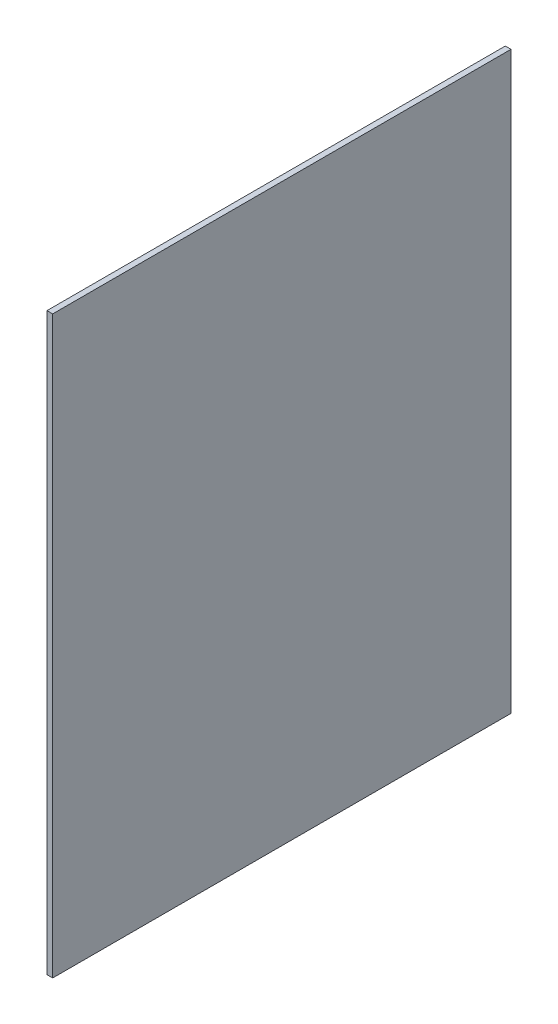
ISO-10303-21;
HEADER;
FILE_DESCRIPTION(('STEP AP214'),'2;1');
FILE_NAME('part.step','',(''),(''),'','','');
FILE_SCHEMA(('AUTOMOTIVE_DESIGN { 1 0 10303 214 1 1 1 1 }'));
ENDSEC;
DATA;
#1=APPLICATION_CONTEXT('core data for automotive mechanical design processes');
#2=APPLICATION_PROTOCOL_DEFINITION('international standard','automotive_design',2000,#1);
#3=PRODUCT_CONTEXT('',#1,'mechanical');
#4=PRODUCT('Part','Part','',(#3));
#5=PRODUCT_RELATED_PRODUCT_CATEGORY('part','',(#4));
#6=PRODUCT_DEFINITION_FORMATION('','',#4);
#7=PRODUCT_DEFINITION_CONTEXT('part definition',#1,'design');
#8=PRODUCT_DEFINITION('design','',#6,#7);
#9=PRODUCT_DEFINITION_SHAPE('','',#8);
#10=(LENGTH_UNIT() NAMED_UNIT(*) SI_UNIT(.MILLI.,.METRE.));
#11=(NAMED_UNIT(*) PLANE_ANGLE_UNIT() SI_UNIT($,.RADIAN.));
#12=(NAMED_UNIT(*) SI_UNIT($,.STERADIAN.) SOLID_ANGLE_UNIT());
#13=UNCERTAINTY_MEASURE_WITH_UNIT(LENGTH_MEASURE(1.E-05),#10,'distance_accuracy_value','');
#14=(GEOMETRIC_REPRESENTATION_CONTEXT(3) GLOBAL_UNCERTAINTY_ASSIGNED_CONTEXT((#13)) GLOBAL_UNIT_ASSIGNED_CONTEXT((#10,
#11,#12)) REPRESENTATION_CONTEXT('',''));
#15=CARTESIAN_POINT('',(0.,0.,0.));
#16=DIRECTION('',(0.,0.,1.));
#17=DIRECTION('',(1.,0.,0.));
#18=AXIS2_PLACEMENT_3D('',#15,#16,#17);
#19=CARTESIAN_POINT('',(150.88108,-140.88108,112.268));
#20=DIRECTION('',(0.,1.,0.));
#21=DIRECTION('',(0.,0.,1.));
#22=AXIS2_PLACEMENT_3D('',#19,#20,#21);
#23=PLANE('',#22);
#24=DIRECTION('',(1.,0.,0.));
#25=VECTOR('',#24,1.);
#26=CARTESIAN_POINT('',(150.88108,-140.88108,0.));
#27=LINE('',#26,#25);
#28=CARTESIAN_POINT('',(150.88108,-140.88108,0.));
#29=VERTEX_POINT('',#28);
#30=CARTESIAN_POINT('',(152.27554,-140.88108,0.));
#31=VERTEX_POINT('',#30);
#32=EDGE_CURVE('E97',#29,#31,#27,.T.);
#33=ORIENTED_EDGE('',*,*,#32,.T.);
#34=DIRECTION('',(0.,0.,-1.));
#35=VECTOR('',#34,1.);
#36=CARTESIAN_POINT('',(152.27554,-140.88108,112.268));
#37=LINE('',#36,#35);
#38=CARTESIAN_POINT('',(152.27554,-140.88108,112.268));
#39=VERTEX_POINT('',#38);
#40=EDGE_CURVE('E11',#39,#31,#37,.T.);
#41=ORIENTED_EDGE('',*,*,#40,.F.);
#42=DIRECTION('',(1.,0.,0.));
#43=VECTOR('',#42,1.);
#44=CARTESIAN_POINT('',(150.88108,-140.88108,112.268));
#45=LINE('',#44,#43);
#46=CARTESIAN_POINT('',(150.88108,-140.88108,112.268));
#47=VERTEX_POINT('',#46);
#48=EDGE_CURVE('E85',#47,#39,#45,.T.);
#49=ORIENTED_EDGE('',*,*,#48,.F.);
#50=DIRECTION('',(0.,0.,-1.));
#51=VECTOR('',#50,1.);
#52=CARTESIAN_POINT('',(150.88108,-140.88108,112.268));
#53=LINE('',#52,#51);
#54=EDGE_CURVE('E93',#47,#29,#53,.T.);
#55=ORIENTED_EDGE('',*,*,#54,.T.);
#56=EDGE_LOOP('',(#33,#41,#49,#55));
#57=FACE_BOUND('',#56,.T.);
#58=ADVANCED_FACE('F34',(#57),#23,.F.);
#59=CARTESIAN_POINT('',(152.27554,0.,112.268));
#60=DIRECTION('',(-1.,0.,0.));
#61=DIRECTION('',(0.,-1.,0.));
#62=AXIS2_PLACEMENT_3D('',#59,#60,#61);
#63=PLANE('',#62);
#64=DIRECTION('',(0.,1.,0.));
#65=VECTOR('',#64,1.);
#66=CARTESIAN_POINT('',(152.27554,0.,0.));
#67=LINE('',#66,#65);
#68=CARTESIAN_POINT('',(152.27554,0.,0.));
#69=VERTEX_POINT('',#68);
#70=EDGE_CURVE('E89',#31,#69,#67,.T.);
#71=ORIENTED_EDGE('',*,*,#70,.T.);
#72=DIRECTION('',(0.,0.,-1.));
#73=VECTOR('',#72,1.);
#74=CARTESIAN_POINT('',(152.27554,0.,112.268));
#75=LINE('',#74,#73);
#76=CARTESIAN_POINT('',(152.27554,0.,112.268));
#77=VERTEX_POINT('',#76);
#78=EDGE_CURVE('E42',#77,#69,#75,.T.);
#79=ORIENTED_EDGE('',*,*,#78,.F.);
#80=DIRECTION('',(0.,1.,0.));
#81=VECTOR('',#80,1.);
#82=CARTESIAN_POINT('',(152.27554,0.,112.268));
#83=LINE('',#82,#81);
#84=EDGE_CURVE('E80',#39,#77,#83,.T.);
#85=ORIENTED_EDGE('',*,*,#84,.F.);
#86=ORIENTED_EDGE('',*,*,#40,.T.);
#87=EDGE_LOOP('',(#71,#79,#85,#86));
#88=FACE_BOUND('',#87,.T.);
#89=ADVANCED_FACE('F88',(#88),#63,.F.);
#90=CARTESIAN_POINT('',(150.88108,0.,112.268));
#91=DIRECTION('',(0.,-1.,0.));
#92=DIRECTION('',(0.,0.,-1.));
#93=AXIS2_PLACEMENT_3D('',#90,#91,#92);
#94=PLANE('',#93);
#95=DIRECTION('',(-1.,0.,0.));
#96=VECTOR('',#95,1.);
#97=CARTESIAN_POINT('',(150.88108,0.,0.));
#98=LINE('',#97,#96);
#99=CARTESIAN_POINT('',(150.88108,0.,0.));
#100=VERTEX_POINT('',#99);
#101=EDGE_CURVE('E67',#69,#100,#98,.T.);
#102=ORIENTED_EDGE('',*,*,#101,.T.);
#103=DIRECTION('',(0.,0.,-1.));
#104=VECTOR('',#103,1.);
#105=CARTESIAN_POINT('',(150.88108,0.,112.268));
#106=LINE('',#105,#104);
#107=CARTESIAN_POINT('',(150.88108,0.,112.268));
#108=VERTEX_POINT('',#107);
#109=EDGE_CURVE('E90',#108,#100,#106,.T.);
#110=ORIENTED_EDGE('',*,*,#109,.F.);
#111=DIRECTION('',(-1.,0.,0.));
#112=VECTOR('',#111,1.);
#113=CARTESIAN_POINT('',(150.88108,0.,112.268));
#114=LINE('',#113,#112);
#115=EDGE_CURVE('E83',#77,#108,#114,.T.);
#116=ORIENTED_EDGE('',*,*,#115,.F.);
#117=ORIENTED_EDGE('',*,*,#78,.T.);
#118=EDGE_LOOP('',(#102,#110,#116,#117));
#119=FACE_BOUND('',#118,.T.);
#120=ADVANCED_FACE('F91',(#119),#94,.F.);
#121=CARTESIAN_POINT('',(150.88108,-140.88108,112.268));
#122=DIRECTION('',(1.,0.,0.));
#123=DIRECTION('',(0.,1.,0.));
#124=AXIS2_PLACEMENT_3D('',#121,#122,#123);
#125=PLANE('',#124);
#126=DIRECTION('',(0.,-1.,0.));
#127=VECTOR('',#126,1.);
#128=CARTESIAN_POINT('',(150.88108,-140.88108,0.));
#129=LINE('',#128,#127);
#130=EDGE_CURVE('E73',#100,#29,#129,.T.);
#131=ORIENTED_EDGE('',*,*,#130,.T.);
#132=ORIENTED_EDGE('',*,*,#54,.F.);
#133=DIRECTION('',(0.,-1.,0.));
#134=VECTOR('',#133,1.);
#135=CARTESIAN_POINT('',(150.88108,-140.88108,112.268));
#136=LINE('',#135,#134);
#137=EDGE_CURVE('E50',#108,#47,#136,.T.);
#138=ORIENTED_EDGE('',*,*,#137,.F.);
#139=ORIENTED_EDGE('',*,*,#109,.T.);
#140=EDGE_LOOP('',(#131,#132,#138,#139));
#141=FACE_BOUND('',#140,.T.);
#142=ADVANCED_FACE('F104',(#141),#125,.F.);
#143=CARTESIAN_POINT('',(0.,0.,112.268));
#144=DIRECTION('',(0.,0.,-1.));
#145=DIRECTION('',(-1.,0.,0.));
#146=AXIS2_PLACEMENT_3D('',#143,#144,#145);
#147=PLANE('',#146);
#148=ORIENTED_EDGE('',*,*,#48,.T.);
#149=ORIENTED_EDGE('',*,*,#84,.T.);
#150=ORIENTED_EDGE('',*,*,#115,.T.);
#151=ORIENTED_EDGE('',*,*,#137,.T.);
#152=EDGE_LOOP('',(#148,#149,#150,#151));
#153=FACE_BOUND('',#152,.T.);
#154=ADVANCED_FACE('F81',(#153),#147,.F.);
#155=CARTESIAN_POINT('',(0.,0.,0.));
#156=DIRECTION('',(0.,0.,-1.));
#157=DIRECTION('',(-1.,0.,0.));
#158=AXIS2_PLACEMENT_3D('',#155,#156,#157);
#159=PLANE('',#158);
#160=ORIENTED_EDGE('',*,*,#32,.F.);
#161=ORIENTED_EDGE('',*,*,#130,.F.);
#162=ORIENTED_EDGE('',*,*,#101,.F.);
#163=ORIENTED_EDGE('',*,*,#70,.F.);
#164=EDGE_LOOP('',(#160,#161,#162,#163));
#165=FACE_BOUND('',#164,.T.);
#166=ADVANCED_FACE('F107',(#165),#159,.T.);
#167=CLOSED_SHELL('',(#58,#89,#120,#142,#154,#166));
#168=MANIFOLD_SOLID_BREP('B2',#167);
#169=ADVANCED_BREP_SHAPE_REPRESENTATION('',(#18,#168),#14);
#170=SHAPE_DEFINITION_REPRESENTATION(#9,#169);
ENDSEC;
END-ISO-10303-21;
